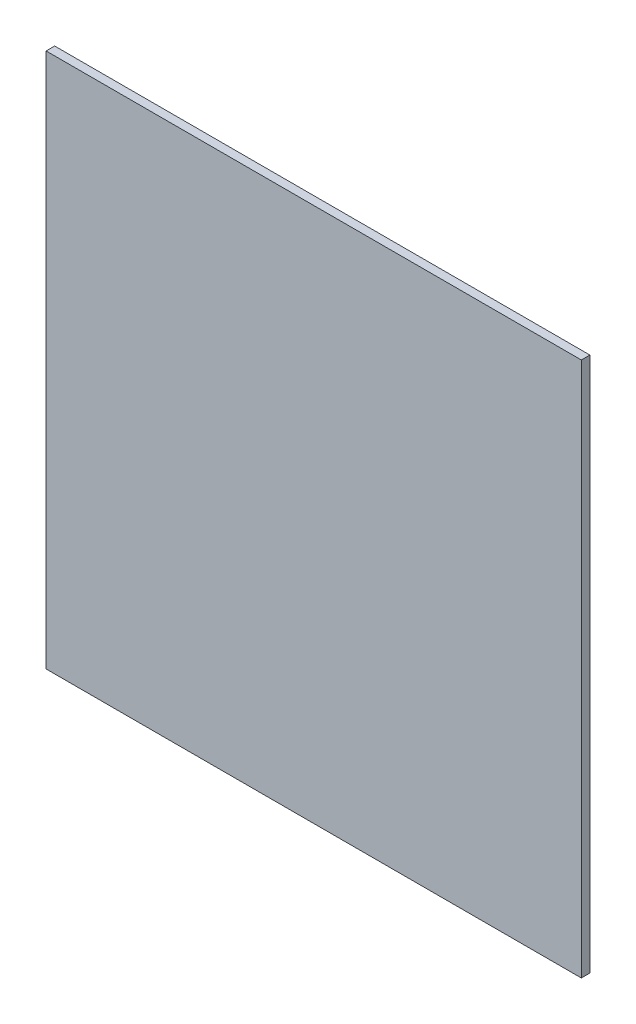
ISO-10303-21;
HEADER;
FILE_DESCRIPTION(('STEP AP214'),'2;1');
FILE_NAME('part.step','',(''),(''),'','','');
FILE_SCHEMA(('AUTOMOTIVE_DESIGN { 1 0 10303 214 1 1 1 1 }'));
ENDSEC;
DATA;
#1=APPLICATION_CONTEXT('core data for automotive mechanical design processes');
#2=APPLICATION_PROTOCOL_DEFINITION('international standard','automotive_design',2000,#1);
#3=PRODUCT_CONTEXT('',#1,'mechanical');
#4=PRODUCT('Part','Part','',(#3));
#5=PRODUCT_RELATED_PRODUCT_CATEGORY('part','',(#4));
#6=PRODUCT_DEFINITION_FORMATION('','',#4);
#7=PRODUCT_DEFINITION_CONTEXT('part definition',#1,'design');
#8=PRODUCT_DEFINITION('design','',#6,#7);
#9=PRODUCT_DEFINITION_SHAPE('','',#8);
#10=(LENGTH_UNIT() NAMED_UNIT(*) SI_UNIT(.MILLI.,.METRE.));
#11=(NAMED_UNIT(*) PLANE_ANGLE_UNIT() SI_UNIT($,.RADIAN.));
#12=(NAMED_UNIT(*) SI_UNIT($,.STERADIAN.) SOLID_ANGLE_UNIT());
#13=UNCERTAINTY_MEASURE_WITH_UNIT(LENGTH_MEASURE(1.E-05),#10,'distance_accuracy_value','');
#14=(GEOMETRIC_REPRESENTATION_CONTEXT(3) GLOBAL_UNCERTAINTY_ASSIGNED_CONTEXT((#13)) GLOBAL_UNIT_ASSIGNED_CONTEXT((#10,
#11,#12)) REPRESENTATION_CONTEXT('',''));
#15=CARTESIAN_POINT('',(0.,0.,0.));
#16=DIRECTION('',(0.,0.,1.));
#17=DIRECTION('',(1.,0.,0.));
#18=AXIS2_PLACEMENT_3D('',#15,#16,#17);
#19=CARTESIAN_POINT('',(62.5,-62.5,2.));
#20=DIRECTION('',(-1.,0.,0.));
#21=DIRECTION('',(0.,0.,1.));
#22=AXIS2_PLACEMENT_3D('',#19,#20,#21);
#23=PLANE('',#22);
#24=DIRECTION('',(0.,1.,0.));
#25=VECTOR('',#24,1.);
#26=CARTESIAN_POINT('',(62.5,-62.5,0.));
#27=LINE('',#26,#25);
#28=CARTESIAN_POINT('',(62.5,-62.5,0.));
#29=VERTEX_POINT('',#28);
#30=CARTESIAN_POINT('',(62.5,62.5,0.));
#31=VERTEX_POINT('',#30);
#32=EDGE_CURVE('E96',#29,#31,#27,.T.);
#33=ORIENTED_EDGE('',*,*,#32,.T.);
#34=DIRECTION('',(0.,0.,-1.));
#35=VECTOR('',#34,1.);
#36=CARTESIAN_POINT('',(62.5,62.5,2.));
#37=LINE('',#36,#35);
#38=CARTESIAN_POINT('',(62.5,62.5,2.));
#39=VERTEX_POINT('',#38);
#40=EDGE_CURVE('E11',#39,#31,#37,.T.);
#41=ORIENTED_EDGE('',*,*,#40,.F.);
#42=DIRECTION('',(0.,1.,0.));
#43=VECTOR('',#42,1.);
#44=CARTESIAN_POINT('',(62.5,-62.5,2.));
#45=LINE('',#44,#43);
#46=CARTESIAN_POINT('',(62.5,-62.5,2.));
#47=VERTEX_POINT('',#46);
#48=EDGE_CURVE('E84',#47,#39,#45,.T.);
#49=ORIENTED_EDGE('',*,*,#48,.F.);
#50=DIRECTION('',(0.,0.,-1.));
#51=VECTOR('',#50,1.);
#52=CARTESIAN_POINT('',(62.5,-62.5,2.));
#53=LINE('',#52,#51);
#54=EDGE_CURVE('E92',#47,#29,#53,.T.);
#55=ORIENTED_EDGE('',*,*,#54,.T.);
#56=EDGE_LOOP('',(#33,#41,#49,#55));
#57=FACE_BOUND('',#56,.T.);
#58=ADVANCED_FACE('F33',(#57),#23,.F.);
#59=CARTESIAN_POINT('',(-62.5,62.5,2.));
#60=DIRECTION('',(0.,-1.,0.));
#61=DIRECTION('',(0.,0.,-1.));
#62=AXIS2_PLACEMENT_3D('',#59,#60,#61);
#63=PLANE('',#62);
#64=DIRECTION('',(-1.,0.,0.));
#65=VECTOR('',#64,1.);
#66=CARTESIAN_POINT('',(-62.5,62.5,0.));
#67=LINE('',#66,#65);
#68=CARTESIAN_POINT('',(-62.5,62.5,0.));
#69=VERTEX_POINT('',#68);
#70=EDGE_CURVE('E88',#31,#69,#67,.T.);
#71=ORIENTED_EDGE('',*,*,#70,.T.);
#72=DIRECTION('',(0.,0.,-1.));
#73=VECTOR('',#72,1.);
#74=CARTESIAN_POINT('',(-62.5,62.5,2.));
#75=LINE('',#74,#73);
#76=CARTESIAN_POINT('',(-62.5,62.5,2.));
#77=VERTEX_POINT('',#76);
#78=EDGE_CURVE('E41',#77,#69,#75,.T.);
#79=ORIENTED_EDGE('',*,*,#78,.F.);
#80=DIRECTION('',(-1.,0.,0.));
#81=VECTOR('',#80,1.);
#82=CARTESIAN_POINT('',(-62.5,62.5,2.));
#83=LINE('',#82,#81);
#84=EDGE_CURVE('E79',#39,#77,#83,.T.);
#85=ORIENTED_EDGE('',*,*,#84,.F.);
#86=ORIENTED_EDGE('',*,*,#40,.T.);
#87=EDGE_LOOP('',(#71,#79,#85,#86));
#88=FACE_BOUND('',#87,.T.);
#89=ADVANCED_FACE('F87',(#88),#63,.F.);
#90=CARTESIAN_POINT('',(-62.5,-62.5,2.));
#91=DIRECTION('',(1.,0.,0.));
#92=DIRECTION('',(0.,0.,-1.));
#93=AXIS2_PLACEMENT_3D('',#90,#91,#92);
#94=PLANE('',#93);
#95=DIRECTION('',(0.,-1.,0.));
#96=VECTOR('',#95,1.);
#97=CARTESIAN_POINT('',(-62.5,-62.5,0.));
#98=LINE('',#97,#96);
#99=CARTESIAN_POINT('',(-62.5,-62.5,0.));
#100=VERTEX_POINT('',#99);
#101=EDGE_CURVE('E66',#69,#100,#98,.T.);
#102=ORIENTED_EDGE('',*,*,#101,.T.);
#103=DIRECTION('',(0.,0.,-1.));
#104=VECTOR('',#103,1.);
#105=CARTESIAN_POINT('',(-62.5,-62.5,2.));
#106=LINE('',#105,#104);
#107=CARTESIAN_POINT('',(-62.5,-62.5,2.));
#108=VERTEX_POINT('',#107);
#109=EDGE_CURVE('E89',#108,#100,#106,.T.);
#110=ORIENTED_EDGE('',*,*,#109,.F.);
#111=DIRECTION('',(0.,-1.,0.));
#112=VECTOR('',#111,1.);
#113=CARTESIAN_POINT('',(-62.5,-62.5,2.));
#114=LINE('',#113,#112);
#115=EDGE_CURVE('E82',#77,#108,#114,.T.);
#116=ORIENTED_EDGE('',*,*,#115,.F.);
#117=ORIENTED_EDGE('',*,*,#78,.T.);
#118=EDGE_LOOP('',(#102,#110,#116,#117));
#119=FACE_BOUND('',#118,.T.);
#120=ADVANCED_FACE('F90',(#119),#94,.F.);
#121=CARTESIAN_POINT('',(-62.5,-62.5,2.));
#122=DIRECTION('',(0.,1.,0.));
#123=DIRECTION('',(0.,0.,1.));
#124=AXIS2_PLACEMENT_3D('',#121,#122,#123);
#125=PLANE('',#124);
#126=DIRECTION('',(1.,0.,0.));
#127=VECTOR('',#126,1.);
#128=CARTESIAN_POINT('',(-62.5,-62.5,0.));
#129=LINE('',#128,#127);
#130=EDGE_CURVE('E72',#100,#29,#129,.T.);
#131=ORIENTED_EDGE('',*,*,#130,.T.);
#132=ORIENTED_EDGE('',*,*,#54,.F.);
#133=DIRECTION('',(1.,0.,0.));
#134=VECTOR('',#133,1.);
#135=CARTESIAN_POINT('',(-62.5,-62.5,2.));
#136=LINE('',#135,#134);
#137=EDGE_CURVE('E49',#108,#47,#136,.T.);
#138=ORIENTED_EDGE('',*,*,#137,.F.);
#139=ORIENTED_EDGE('',*,*,#109,.T.);
#140=EDGE_LOOP('',(#131,#132,#138,#139));
#141=FACE_BOUND('',#140,.T.);
#142=ADVANCED_FACE('F103',(#141),#125,.F.);
#143=CARTESIAN_POINT('',(0.,0.,2.));
#144=DIRECTION('',(0.,0.,-1.));
#145=DIRECTION('',(-1.,0.,0.));
#146=AXIS2_PLACEMENT_3D('',#143,#144,#145);
#147=PLANE('',#146);
#148=ORIENTED_EDGE('',*,*,#48,.T.);
#149=ORIENTED_EDGE('',*,*,#84,.T.);
#150=ORIENTED_EDGE('',*,*,#115,.T.);
#151=ORIENTED_EDGE('',*,*,#137,.T.);
#152=EDGE_LOOP('',(#148,#149,#150,#151));
#153=FACE_BOUND('',#152,.T.);
#154=ADVANCED_FACE('F80',(#153),#147,.F.);
#155=CARTESIAN_POINT('',(0.,0.,0.));
#156=DIRECTION('',(0.,0.,-1.));
#157=DIRECTION('',(-1.,0.,0.));
#158=AXIS2_PLACEMENT_3D('',#155,#156,#157);
#159=PLANE('',#158);
#160=ORIENTED_EDGE('',*,*,#32,.F.);
#161=ORIENTED_EDGE('',*,*,#130,.F.);
#162=ORIENTED_EDGE('',*,*,#101,.F.);
#163=ORIENTED_EDGE('',*,*,#70,.F.);
#164=EDGE_LOOP('',(#160,#161,#162,#163));
#165=FACE_BOUND('',#164,.T.);
#166=ADVANCED_FACE('F106',(#165),#159,.T.);
#167=CLOSED_SHELL('',(#58,#89,#120,#142,#154,#166));
#168=MANIFOLD_SOLID_BREP('B2',#167);
#169=ADVANCED_BREP_SHAPE_REPRESENTATION('',(#18,#168),#14);
#170=SHAPE_DEFINITION_REPRESENTATION(#9,#169);
ENDSEC;
END-ISO-10303-21;
